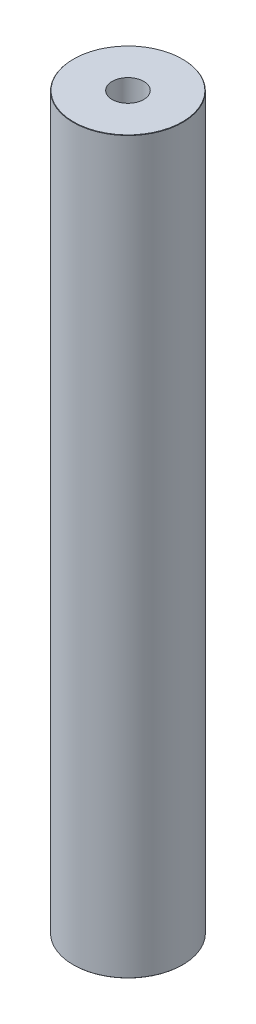
ISO-10303-21;
HEADER;
FILE_DESCRIPTION(('STEP AP214'),'2;1');
FILE_NAME('part.step','',(''),(''),'','','');
FILE_SCHEMA(('AUTOMOTIVE_DESIGN { 1 0 10303 214 1 1 1 1 }'));
ENDSEC;
DATA;
#1=APPLICATION_CONTEXT('core data for automotive mechanical design processes');
#2=APPLICATION_PROTOCOL_DEFINITION('international standard','automotive_design',2000,#1);
#3=PRODUCT_CONTEXT('',#1,'mechanical');
#4=PRODUCT('Part','Part','',(#3));
#5=PRODUCT_RELATED_PRODUCT_CATEGORY('part','',(#4));
#6=PRODUCT_DEFINITION_FORMATION('','',#4);
#7=PRODUCT_DEFINITION_CONTEXT('part definition',#1,'design');
#8=PRODUCT_DEFINITION('design','',#6,#7);
#9=PRODUCT_DEFINITION_SHAPE('','',#8);
#10=(LENGTH_UNIT() NAMED_UNIT(*) SI_UNIT(.MILLI.,.METRE.));
#11=(NAMED_UNIT(*) PLANE_ANGLE_UNIT() SI_UNIT($,.RADIAN.));
#12=(NAMED_UNIT(*) SI_UNIT($,.STERADIAN.) SOLID_ANGLE_UNIT());
#13=UNCERTAINTY_MEASURE_WITH_UNIT(LENGTH_MEASURE(1.E-05),#10,'distance_accuracy_value','');
#14=(GEOMETRIC_REPRESENTATION_CONTEXT(3) GLOBAL_UNCERTAINTY_ASSIGNED_CONTEXT((#13)) GLOBAL_UNIT_ASSIGNED_CONTEXT((#10,
#11,#12)) REPRESENTATION_CONTEXT('',''));
#15=CARTESIAN_POINT('',(0.,0.,0.));
#16=DIRECTION('',(0.,0.,1.));
#17=DIRECTION('',(1.,0.,0.));
#18=AXIS2_PLACEMENT_3D('',#15,#16,#17);
#19=CARTESIAN_POINT('',(0.,600.,0.));
#20=DIRECTION('',(0.,-1.,0.));
#21=DIRECTION('',(0.,0.,-1.));
#22=AXIS2_PLACEMENT_3D('',#19,#20,#21);
#23=CYLINDRICAL_SURFACE('',#22,45.);
#24=CARTESIAN_POINT('',(0.,599.728729176384,0.));
#25=DIRECTION('',(0.,1.,0.));
#26=DIRECTION('',(0.,0.,1.));
#27=AXIS2_PLACEMENT_3D('',#24,#25,#26);
#28=CIRCLE('',#27,45.);
#29=CARTESIAN_POINT('',(0.,599.728729176384,45.));
#30=VERTEX_POINT('',#29);
#31=EDGE_CURVE('E50',#30,#30,#28,.F.);
#32=ORIENTED_EDGE('',*,*,#31,.T.);
#33=EDGE_LOOP('',(#32));
#34=FACE_BOUND('',#33,.T.);
#35=CARTESIAN_POINT('',(0.,0.271270823615888,0.));
#36=DIRECTION('',(0.,1.,0.));
#37=DIRECTION('',(0.,0.,1.));
#38=AXIS2_PLACEMENT_3D('',#35,#36,#37);
#39=CIRCLE('',#38,45.);
#40=CARTESIAN_POINT('',(0.,0.271270823615888,45.));
#41=VERTEX_POINT('',#40);
#42=EDGE_CURVE('E51',#41,#41,#39,.T.);
#43=ORIENTED_EDGE('',*,*,#42,.T.);
#44=EDGE_LOOP('',(#43));
#45=FACE_BOUND('',#44,.T.);
#46=ADVANCED_FACE('F39',(#34,#45),#23,.T.);
#47=CARTESIAN_POINT('',(0.,600.,0.));
#48=DIRECTION('',(0.,1.,0.));
#49=DIRECTION('',(0.,0.,1.));
#50=AXIS2_PLACEMENT_3D('',#47,#48,#49);
#51=PLANE('',#50);
#52=CARTESIAN_POINT('',(0.,600.,0.));
#53=DIRECTION('',(0.,1.,0.));
#54=DIRECTION('',(0.,0.,1.));
#55=AXIS2_PLACEMENT_3D('',#52,#53,#54);
#56=CIRCLE('',#55,44.7287291763842);
#57=CARTESIAN_POINT('',(0.,600.,44.7287291763842));
#58=VERTEX_POINT('',#57);
#59=EDGE_CURVE('E54',#58,#58,#56,.T.);
#60=ORIENTED_EDGE('',*,*,#59,.T.);
#61=EDGE_LOOP('',(#60));
#62=FACE_BOUND('',#61,.T.);
#63=CARTESIAN_POINT('',(0.,600.,0.));
#64=DIRECTION('',(0.,1.,0.));
#65=DIRECTION('',(0.,0.,1.));
#66=AXIS2_PLACEMENT_3D('',#63,#64,#65);
#67=CIRCLE('',#66,12.9662674556388);
#68=CARTESIAN_POINT('',(0.,600.,12.9662674556388));
#69=VERTEX_POINT('',#68);
#70=EDGE_CURVE('E58',#69,#69,#67,.T.);
#71=ORIENTED_EDGE('',*,*,#70,.F.);
#72=EDGE_LOOP('',(#71));
#73=FACE_BOUND('',#72,.T.);
#74=ADVANCED_FACE('F69',(#62,#73),#51,.T.);
#75=CARTESIAN_POINT('',(0.,0.,0.));
#76=DIRECTION('',(0.,1.,0.));
#77=DIRECTION('',(0.,0.,1.));
#78=AXIS2_PLACEMENT_3D('',#75,#76,#77);
#79=PLANE('',#78);
#80=CARTESIAN_POINT('',(0.,0.,0.));
#81=DIRECTION('',(0.,1.,0.));
#82=DIRECTION('',(0.,0.,1.));
#83=AXIS2_PLACEMENT_3D('',#80,#81,#82);
#84=CIRCLE('',#83,44.7287291763842);
#85=CARTESIAN_POINT('',(0.,0.,44.7287291763842));
#86=VERTEX_POINT('',#85);
#87=EDGE_CURVE('E10',#86,#86,#84,.F.);
#88=ORIENTED_EDGE('',*,*,#87,.T.);
#89=EDGE_LOOP('',(#88));
#90=FACE_BOUND('',#89,.T.);
#91=CARTESIAN_POINT('',(0.,0.,0.));
#92=DIRECTION('',(0.,1.,0.));
#93=DIRECTION('',(0.,0.,1.));
#94=AXIS2_PLACEMENT_3D('',#91,#92,#93);
#95=CIRCLE('',#94,12.9662674556388);
#96=CARTESIAN_POINT('',(0.,0.,12.9662674556388));
#97=VERTEX_POINT('',#96);
#98=EDGE_CURVE('E63',#97,#97,#95,.T.);
#99=ORIENTED_EDGE('',*,*,#98,.T.);
#100=EDGE_LOOP('',(#99));
#101=FACE_BOUND('',#100,.T.);
#102=ADVANCED_FACE('F75',(#90,#101),#79,.F.);
#103=CARTESIAN_POINT('',(0.,600.,0.));
#104=DIRECTION('',(0.,-1.,0.));
#105=DIRECTION('',(0.,0.,-1.));
#106=AXIS2_PLACEMENT_3D('',#103,#104,#105);
#107=CYLINDRICAL_SURFACE('',#106,12.9662674556388);
#108=ORIENTED_EDGE('',*,*,#70,.T.);
#109=EDGE_LOOP('',(#108));
#110=FACE_BOUND('',#109,.T.);
#111=ORIENTED_EDGE('',*,*,#98,.F.);
#112=EDGE_LOOP('',(#111));
#113=FACE_BOUND('',#112,.T.);
#114=ADVANCED_FACE('F70',(#110,#113),#107,.F.);
#115=CARTESIAN_POINT('',(0.,600.,0.));
#116=DIRECTION('',(0.,-1.,0.));
#117=DIRECTION('',(0.,0.,-1.));
#118=AXIS2_PLACEMENT_3D('',#115,#116,#117);
#119=CONICAL_SURFACE('',#118,44.7287291763842,0.785398163397282);
#120=ORIENTED_EDGE('',*,*,#31,.F.);
#121=EDGE_LOOP('',(#120));
#122=FACE_BOUND('',#121,.T.);
#123=ORIENTED_EDGE('',*,*,#59,.F.);
#124=EDGE_LOOP('',(#123));
#125=FACE_BOUND('',#124,.T.);
#126=ADVANCED_FACE('F81',(#122,#125),#119,.T.);
#127=CARTESIAN_POINT('',(0.,0.271270823615888,0.));
#128=DIRECTION('',(0.,1.,0.));
#129=DIRECTION('',(0.,0.,1.));
#130=AXIS2_PLACEMENT_3D('',#127,#128,#129);
#131=CONICAL_SURFACE('',#130,45.,0.785398163397295);
#132=ORIENTED_EDGE('',*,*,#87,.F.);
#133=EDGE_LOOP('',(#132));
#134=FACE_BOUND('',#133,.T.);
#135=ORIENTED_EDGE('',*,*,#42,.F.);
#136=EDGE_LOOP('',(#135));
#137=FACE_BOUND('',#136,.T.);
#138=ADVANCED_FACE('F45',(#134,#137),#131,.T.);
#139=CLOSED_SHELL('',(#46,#74,#102,#114,#126,#138));
#140=MANIFOLD_SOLID_BREP('B2',#139);
#141=ADVANCED_BREP_SHAPE_REPRESENTATION('',(#18,#140),#14);
#142=SHAPE_DEFINITION_REPRESENTATION(#9,#141);
ENDSEC;
END-ISO-10303-21;
